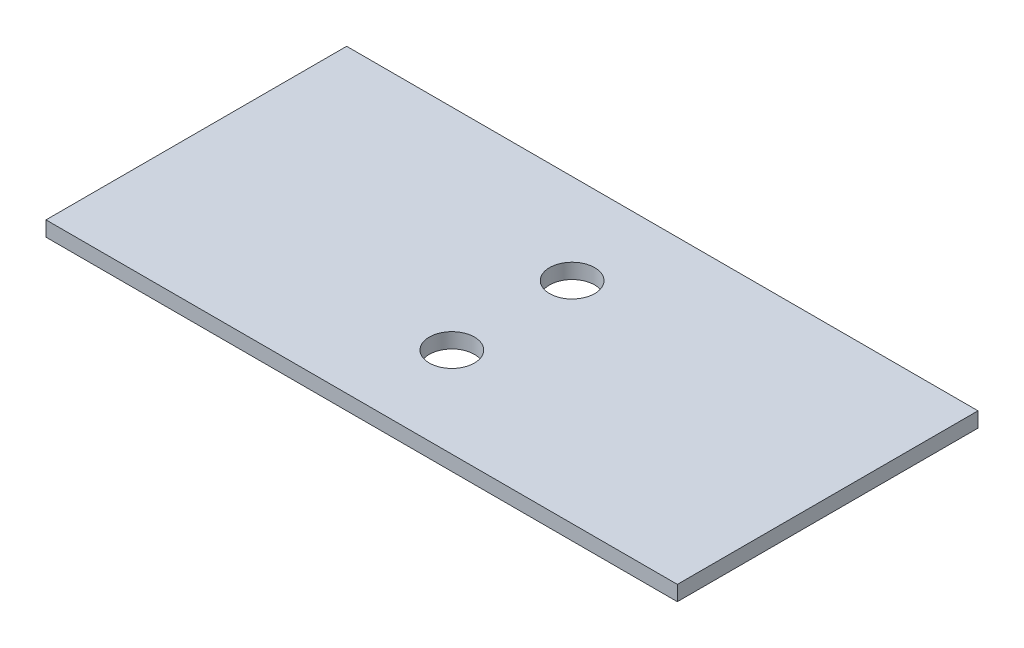
ISO-10303-21;
HEADER;
FILE_DESCRIPTION(('STEP AP214'),'2;1');
FILE_NAME('part.step','',(''),(''),'','','');
FILE_SCHEMA(('AUTOMOTIVE_DESIGN { 1 0 10303 214 1 1 1 1 }'));
ENDSEC;
DATA;
#1=APPLICATION_CONTEXT('core data for automotive mechanical design processes');
#2=APPLICATION_PROTOCOL_DEFINITION('international standard','automotive_design',2000,#1);
#3=PRODUCT_CONTEXT('',#1,'mechanical');
#4=PRODUCT('Part','Part','',(#3));
#5=PRODUCT_RELATED_PRODUCT_CATEGORY('part','',(#4));
#6=PRODUCT_DEFINITION_FORMATION('','',#4);
#7=PRODUCT_DEFINITION_CONTEXT('part definition',#1,'design');
#8=PRODUCT_DEFINITION('design','',#6,#7);
#9=PRODUCT_DEFINITION_SHAPE('','',#8);
#10=(LENGTH_UNIT() NAMED_UNIT(*) SI_UNIT(.MILLI.,.METRE.));
#11=(NAMED_UNIT(*) PLANE_ANGLE_UNIT() SI_UNIT($,.RADIAN.));
#12=(NAMED_UNIT(*) SI_UNIT($,.STERADIAN.) SOLID_ANGLE_UNIT());
#13=UNCERTAINTY_MEASURE_WITH_UNIT(LENGTH_MEASURE(1.E-05),#10,'distance_accuracy_value','');
#14=(GEOMETRIC_REPRESENTATION_CONTEXT(3) GLOBAL_UNCERTAINTY_ASSIGNED_CONTEXT((#13)) GLOBAL_UNIT_ASSIGNED_CONTEXT((#10,
#11,#12)) REPRESENTATION_CONTEXT('',''));
#15=CARTESIAN_POINT('',(0.,0.,0.));
#16=DIRECTION('',(0.,0.,1.));
#17=DIRECTION('',(1.,0.,0.));
#18=AXIS2_PLACEMENT_3D('',#15,#16,#17);
#19=CARTESIAN_POINT('',(0.,1.,0.));
#20=DIRECTION('',(0.,-1.,0.));
#21=DIRECTION('',(0.,0.,-1.));
#22=AXIS2_PLACEMENT_3D('',#19,#20,#21);
#23=PLANE('',#22);
#24=DIRECTION('',(0.,0.,1.));
#25=VECTOR('',#24,1.);
#26=CARTESIAN_POINT('',(0.,1.,0.));
#27=LINE('',#26,#25);
#28=CARTESIAN_POINT('',(0.,1.,-20.));
#29=VERTEX_POINT('',#28);
#30=CARTESIAN_POINT('',(0.,1.,0.));
#31=VERTEX_POINT('',#30);
#32=EDGE_CURVE('E86',#29,#31,#27,.T.);
#33=ORIENTED_EDGE('',*,*,#32,.T.);
#34=DIRECTION('',(1.,0.,0.));
#35=VECTOR('',#34,1.);
#36=CARTESIAN_POINT('',(0.,1.,0.));
#37=LINE('',#36,#35);
#38=CARTESIAN_POINT('',(42.,1.,0.));
#39=VERTEX_POINT('',#38);
#40=EDGE_CURVE('E81',#31,#39,#37,.T.);
#41=ORIENTED_EDGE('',*,*,#40,.T.);
#42=DIRECTION('',(0.,0.,-1.));
#43=VECTOR('',#42,1.);
#44=CARTESIAN_POINT('',(42.,1.,0.));
#45=LINE('',#44,#43);
#46=CARTESIAN_POINT('',(42.,1.,-20.));
#47=VERTEX_POINT('',#46);
#48=EDGE_CURVE('E84',#39,#47,#45,.T.);
#49=ORIENTED_EDGE('',*,*,#48,.T.);
#50=DIRECTION('',(-1.,0.,0.));
#51=VECTOR('',#50,1.);
#52=CARTESIAN_POINT('',(0.,1.,-20.));
#53=LINE('',#52,#51);
#54=EDGE_CURVE('E51',#47,#29,#53,.T.);
#55=ORIENTED_EDGE('',*,*,#54,.T.);
#56=EDGE_LOOP('',(#33,#41,#49,#55));
#57=FACE_BOUND('',#56,.T.);
#58=CARTESIAN_POINT('',(21.,1.,-14.));
#59=DIRECTION('',(0.,1.,0.));
#60=DIRECTION('',(0.,0.,1.));
#61=AXIS2_PLACEMENT_3D('',#58,#59,#60);
#62=CIRCLE('',#61,1.5);
#63=CARTESIAN_POINT('',(21.,1.,-12.5));
#64=VERTEX_POINT('',#63);
#65=EDGE_CURVE('E101',#64,#64,#62,.T.);
#66=ORIENTED_EDGE('',*,*,#65,.F.);
#67=EDGE_LOOP('',(#66));
#68=FACE_BOUND('',#67,.T.);
#69=CARTESIAN_POINT('',(21.,1.,-6.));
#70=DIRECTION('',(0.,1.,0.));
#71=DIRECTION('',(0.,0.,-1.));
#72=AXIS2_PLACEMENT_3D('',#69,#70,#71);
#73=CIRCLE('',#72,1.5);
#74=CARTESIAN_POINT('',(21.,1.,-7.5));
#75=VERTEX_POINT('',#74);
#76=EDGE_CURVE('E116',#75,#75,#73,.T.);
#77=ORIENTED_EDGE('',*,*,#76,.F.);
#78=EDGE_LOOP('',(#77));
#79=FACE_BOUND('',#78,.T.);
#80=ADVANCED_FACE('F34',(#57,#68,#79),#23,.F.);
#81=CARTESIAN_POINT('',(0.,0.,0.));
#82=DIRECTION('',(0.,-1.,0.));
#83=DIRECTION('',(0.,0.,-1.));
#84=AXIS2_PLACEMENT_3D('',#81,#82,#83);
#85=PLANE('',#84);
#86=CARTESIAN_POINT('',(21.,0.,-14.));
#87=DIRECTION('',(0.,1.,0.));
#88=DIRECTION('',(0.,0.,1.));
#89=AXIS2_PLACEMENT_3D('',#86,#87,#88);
#90=CIRCLE('',#89,1.5);
#91=CARTESIAN_POINT('',(21.,0.,-12.5));
#92=VERTEX_POINT('',#91);
#93=EDGE_CURVE('E113',#92,#92,#90,.T.);
#94=ORIENTED_EDGE('',*,*,#93,.T.);
#95=EDGE_LOOP('',(#94));
#96=FACE_BOUND('',#95,.T.);
#97=DIRECTION('',(0.,0.,1.));
#98=VECTOR('',#97,1.);
#99=CARTESIAN_POINT('',(0.,0.,0.));
#100=LINE('',#99,#98);
#101=CARTESIAN_POINT('',(0.,0.,-20.));
#102=VERTEX_POINT('',#101);
#103=CARTESIAN_POINT('',(0.,0.,0.));
#104=VERTEX_POINT('',#103);
#105=EDGE_CURVE('E98',#102,#104,#100,.T.);
#106=ORIENTED_EDGE('',*,*,#105,.F.);
#107=DIRECTION('',(-1.,0.,0.));
#108=VECTOR('',#107,1.);
#109=CARTESIAN_POINT('',(0.,0.,-20.));
#110=LINE('',#109,#108);
#111=CARTESIAN_POINT('',(42.,0.,-20.));
#112=VERTEX_POINT('',#111);
#113=EDGE_CURVE('E74',#112,#102,#110,.T.);
#114=ORIENTED_EDGE('',*,*,#113,.F.);
#115=DIRECTION('',(0.,0.,-1.));
#116=VECTOR('',#115,1.);
#117=CARTESIAN_POINT('',(42.,0.,0.));
#118=LINE('',#117,#116);
#119=CARTESIAN_POINT('',(42.,0.,0.));
#120=VERTEX_POINT('',#119);
#121=EDGE_CURVE('E68',#120,#112,#118,.T.);
#122=ORIENTED_EDGE('',*,*,#121,.F.);
#123=DIRECTION('',(1.,0.,0.));
#124=VECTOR('',#123,1.);
#125=CARTESIAN_POINT('',(0.,0.,0.));
#126=LINE('',#125,#124);
#127=EDGE_CURVE('E90',#104,#120,#126,.T.);
#128=ORIENTED_EDGE('',*,*,#127,.F.);
#129=EDGE_LOOP('',(#106,#114,#122,#128));
#130=FACE_BOUND('',#129,.T.);
#131=CARTESIAN_POINT('',(21.,0.,-6.));
#132=DIRECTION('',(0.,1.,0.));
#133=DIRECTION('',(0.,0.,-1.));
#134=AXIS2_PLACEMENT_3D('',#131,#132,#133);
#135=CIRCLE('',#134,1.5);
#136=CARTESIAN_POINT('',(21.,0.,-7.5));
#137=VERTEX_POINT('',#136);
#138=EDGE_CURVE('E119',#137,#137,#135,.T.);
#139=ORIENTED_EDGE('',*,*,#138,.T.);
#140=EDGE_LOOP('',(#139));
#141=FACE_BOUND('',#140,.T.);
#142=ADVANCED_FACE('F109',(#96,#130,#141),#85,.T.);
#143=CARTESIAN_POINT('',(0.,1.,0.));
#144=DIRECTION('',(1.,0.,0.));
#145=DIRECTION('',(0.,0.,-1.));
#146=AXIS2_PLACEMENT_3D('',#143,#144,#145);
#147=PLANE('',#146);
#148=ORIENTED_EDGE('',*,*,#105,.T.);
#149=DIRECTION('',(0.,-1.,0.));
#150=VECTOR('',#149,1.);
#151=CARTESIAN_POINT('',(0.,1.,0.));
#152=LINE('',#151,#150);
#153=EDGE_CURVE('E11',#31,#104,#152,.T.);
#154=ORIENTED_EDGE('',*,*,#153,.F.);
#155=ORIENTED_EDGE('',*,*,#32,.F.);
#156=DIRECTION('',(0.,-1.,0.));
#157=VECTOR('',#156,1.);
#158=CARTESIAN_POINT('',(0.,1.,-20.));
#159=LINE('',#158,#157);
#160=EDGE_CURVE('E94',#29,#102,#159,.T.);
#161=ORIENTED_EDGE('',*,*,#160,.T.);
#162=EDGE_LOOP('',(#148,#154,#155,#161));
#163=FACE_BOUND('',#162,.T.);
#164=ADVANCED_FACE('F36',(#163),#147,.F.);
#165=CARTESIAN_POINT('',(0.,1.,0.));
#166=DIRECTION('',(0.,0.,-1.));
#167=DIRECTION('',(-1.,0.,0.));
#168=AXIS2_PLACEMENT_3D('',#165,#166,#167);
#169=PLANE('',#168);
#170=ORIENTED_EDGE('',*,*,#127,.T.);
#171=DIRECTION('',(0.,-1.,0.));
#172=VECTOR('',#171,1.);
#173=CARTESIAN_POINT('',(42.,1.,0.));
#174=LINE('',#173,#172);
#175=EDGE_CURVE('E43',#39,#120,#174,.T.);
#176=ORIENTED_EDGE('',*,*,#175,.F.);
#177=ORIENTED_EDGE('',*,*,#40,.F.);
#178=ORIENTED_EDGE('',*,*,#153,.T.);
#179=EDGE_LOOP('',(#170,#176,#177,#178));
#180=FACE_BOUND('',#179,.T.);
#181=ADVANCED_FACE('F89',(#180),#169,.F.);
#182=CARTESIAN_POINT('',(42.,1.,0.));
#183=DIRECTION('',(-1.,0.,0.));
#184=DIRECTION('',(0.,0.,1.));
#185=AXIS2_PLACEMENT_3D('',#182,#183,#184);
#186=PLANE('',#185);
#187=ORIENTED_EDGE('',*,*,#121,.T.);
#188=DIRECTION('',(0.,-1.,0.));
#189=VECTOR('',#188,1.);
#190=CARTESIAN_POINT('',(42.,1.,-20.));
#191=LINE('',#190,#189);
#192=EDGE_CURVE('E91',#47,#112,#191,.T.);
#193=ORIENTED_EDGE('',*,*,#192,.F.);
#194=ORIENTED_EDGE('',*,*,#48,.F.);
#195=ORIENTED_EDGE('',*,*,#175,.T.);
#196=EDGE_LOOP('',(#187,#193,#194,#195));
#197=FACE_BOUND('',#196,.T.);
#198=ADVANCED_FACE('F92',(#197),#186,.F.);
#199=CARTESIAN_POINT('',(0.,1.,-20.));
#200=DIRECTION('',(0.,0.,1.));
#201=DIRECTION('',(1.,0.,0.));
#202=AXIS2_PLACEMENT_3D('',#199,#200,#201);
#203=PLANE('',#202);
#204=ORIENTED_EDGE('',*,*,#113,.T.);
#205=ORIENTED_EDGE('',*,*,#160,.F.);
#206=ORIENTED_EDGE('',*,*,#54,.F.);
#207=ORIENTED_EDGE('',*,*,#192,.T.);
#208=EDGE_LOOP('',(#204,#205,#206,#207));
#209=FACE_BOUND('',#208,.T.);
#210=ADVANCED_FACE('F106',(#209),#203,.F.);
#211=CARTESIAN_POINT('',(21.,1.,-14.));
#212=DIRECTION('',(0.,-1.,0.));
#213=DIRECTION('',(0.,0.,-1.));
#214=AXIS2_PLACEMENT_3D('',#211,#212,#213);
#215=CYLINDRICAL_SURFACE('',#214,1.5);
#216=ORIENTED_EDGE('',*,*,#65,.T.);
#217=EDGE_LOOP('',(#216));
#218=FACE_BOUND('',#217,.T.);
#219=ORIENTED_EDGE('',*,*,#93,.F.);
#220=EDGE_LOOP('',(#219));
#221=FACE_BOUND('',#220,.T.);
#222=ADVANCED_FACE('F136',(#218,#221),#215,.F.);
#223=CARTESIAN_POINT('',(21.,1.,-6.));
#224=DIRECTION('',(0.,-1.,0.));
#225=DIRECTION('',(0.,0.,-1.));
#226=AXIS2_PLACEMENT_3D('',#223,#224,#225);
#227=CYLINDRICAL_SURFACE('',#226,1.5);
#228=ORIENTED_EDGE('',*,*,#76,.T.);
#229=EDGE_LOOP('',(#228));
#230=FACE_BOUND('',#229,.T.);
#231=ORIENTED_EDGE('',*,*,#138,.F.);
#232=EDGE_LOOP('',(#231));
#233=FACE_BOUND('',#232,.T.);
#234=ADVANCED_FACE('F125',(#230,#233),#227,.F.);
#235=CLOSED_SHELL('',(#80,#142,#164,#181,#198,#210,#222,#234));
#236=MANIFOLD_SOLID_BREP('B2',#235);
#237=ADVANCED_BREP_SHAPE_REPRESENTATION('',(#18,#236),#14);
#238=SHAPE_DEFINITION_REPRESENTATION(#9,#237);
ENDSEC;
END-ISO-10303-21;
